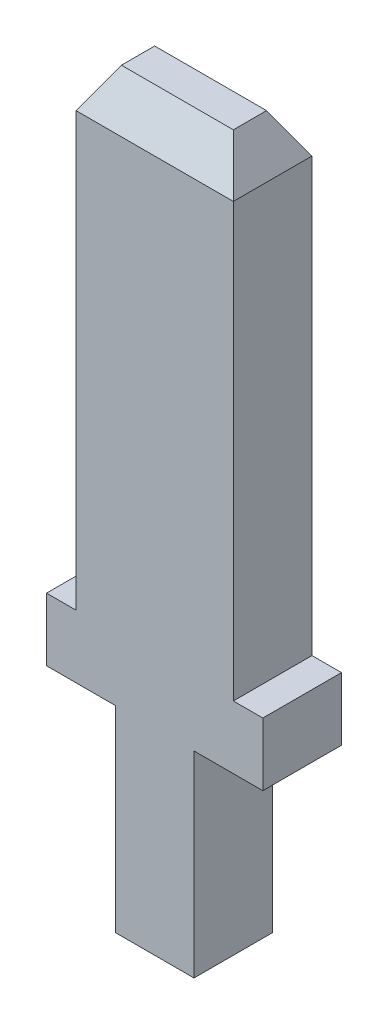
ISO-10303-21;
HEADER;
FILE_DESCRIPTION(('STEP AP214'),'2;1');
FILE_NAME('part.step','',(''),(''),'','','');
FILE_SCHEMA(('AUTOMOTIVE_DESIGN { 1 0 10303 214 1 1 1 1 }'));
ENDSEC;
DATA;
#1=APPLICATION_CONTEXT('core data for automotive mechanical design processes');
#2=APPLICATION_PROTOCOL_DEFINITION('international standard','automotive_design',2000,#1);
#3=PRODUCT_CONTEXT('',#1,'mechanical');
#4=PRODUCT('Part','Part','',(#3));
#5=PRODUCT_RELATED_PRODUCT_CATEGORY('part','',(#4));
#6=PRODUCT_DEFINITION_FORMATION('','',#4);
#7=PRODUCT_DEFINITION_CONTEXT('part definition',#1,'design');
#8=PRODUCT_DEFINITION('design','',#6,#7);
#9=PRODUCT_DEFINITION_SHAPE('','',#8);
#10=(LENGTH_UNIT() NAMED_UNIT(*) SI_UNIT(.MILLI.,.METRE.));
#11=(NAMED_UNIT(*) PLANE_ANGLE_UNIT() SI_UNIT($,.RADIAN.));
#12=(NAMED_UNIT(*) SI_UNIT($,.STERADIAN.) SOLID_ANGLE_UNIT());
#13=UNCERTAINTY_MEASURE_WITH_UNIT(LENGTH_MEASURE(1.E-05),#10,'distance_accuracy_value','');
#14=(GEOMETRIC_REPRESENTATION_CONTEXT(3) GLOBAL_UNCERTAINTY_ASSIGNED_CONTEXT((#13)) GLOBAL_UNIT_ASSIGNED_CONTEXT((#10,
#11,#12)) REPRESENTATION_CONTEXT('',''));
#15=CARTESIAN_POINT('',(0.,0.,0.));
#16=DIRECTION('',(0.,0.,1.));
#17=DIRECTION('',(1.,0.,0.));
#18=AXIS2_PLACEMENT_3D('',#15,#16,#17);
#19=CARTESIAN_POINT('',(-0.999999999999998,0.,1.));
#20=DIRECTION('',(1.,0.,0.));
#21=DIRECTION('',(0.,1.,0.));
#22=AXIS2_PLACEMENT_3D('',#19,#20,#21);
#23=PLANE('',#22);
#24=DIRECTION('',(0.,-1.,0.));
#25=VECTOR('',#24,1.);
#26=CARTESIAN_POINT('',(-0.999999999999998,0.,-1.));
#27=LINE('',#26,#25);
#28=CARTESIAN_POINT('',(-0.999999999999998,5.,-1.));
#29=VERTEX_POINT('',#28);
#30=CARTESIAN_POINT('',(-0.999999999999998,0.,-1.));
#31=VERTEX_POINT('',#30);
#32=EDGE_CURVE('E158',#29,#31,#27,.T.);
#33=ORIENTED_EDGE('',*,*,#32,.T.);
#34=DIRECTION('',(0.,0.,-1.));
#35=VECTOR('',#34,1.);
#36=CARTESIAN_POINT('',(-0.999999999999998,0.,1.));
#37=LINE('',#36,#35);
#38=CARTESIAN_POINT('',(-0.999999999999998,0.,1.));
#39=VERTEX_POINT('',#38);
#40=EDGE_CURVE('E140',#39,#31,#37,.T.);
#41=ORIENTED_EDGE('',*,*,#40,.F.);
#42=DIRECTION('',(0.,-1.,0.));
#43=VECTOR('',#42,1.);
#44=CARTESIAN_POINT('',(-0.999999999999998,0.,1.));
#45=LINE('',#44,#43);
#46=CARTESIAN_POINT('',(-0.999999999999998,5.,1.));
#47=VERTEX_POINT('',#46);
#48=EDGE_CURVE('E146',#47,#39,#45,.T.);
#49=ORIENTED_EDGE('',*,*,#48,.F.);
#50=DIRECTION('',(0.,0.,-1.));
#51=VECTOR('',#50,1.);
#52=CARTESIAN_POINT('',(-0.999999999999998,5.,1.));
#53=LINE('',#52,#51);
#54=EDGE_CURVE('E215',#47,#29,#53,.T.);
#55=ORIENTED_EDGE('',*,*,#54,.T.);
#56=EDGE_LOOP('',(#33,#41,#49,#55));
#57=FACE_BOUND('',#56,.T.);
#58=ADVANCED_FACE('F34',(#57),#23,.F.);
#59=CARTESIAN_POINT('',(0.999999999999998,0.,1.));
#60=DIRECTION('',(0.,1.,0.));
#61=DIRECTION('',(-1.,0.,0.));
#62=AXIS2_PLACEMENT_3D('',#59,#60,#61);
#63=PLANE('',#62);
#64=DIRECTION('',(1.,0.,0.));
#65=VECTOR('',#64,1.);
#66=CARTESIAN_POINT('',(0.999999999999998,0.,-1.));
#67=LINE('',#66,#65);
#68=CARTESIAN_POINT('',(0.999999999999998,0.,-1.));
#69=VERTEX_POINT('',#68);
#70=EDGE_CURVE('E191',#31,#69,#67,.T.);
#71=ORIENTED_EDGE('',*,*,#70,.T.);
#72=DIRECTION('',(0.,0.,-1.));
#73=VECTOR('',#72,1.);
#74=CARTESIAN_POINT('',(0.999999999999998,0.,1.));
#75=LINE('',#74,#73);
#76=CARTESIAN_POINT('',(0.999999999999998,0.,1.));
#77=VERTEX_POINT('',#76);
#78=EDGE_CURVE('E143',#77,#69,#75,.T.);
#79=ORIENTED_EDGE('',*,*,#78,.F.);
#80=DIRECTION('',(1.,0.,0.));
#81=VECTOR('',#80,1.);
#82=CARTESIAN_POINT('',(0.999999999999998,0.,1.));
#83=LINE('',#82,#81);
#84=EDGE_CURVE('E136',#39,#77,#83,.T.);
#85=ORIENTED_EDGE('',*,*,#84,.F.);
#86=ORIENTED_EDGE('',*,*,#40,.T.);
#87=EDGE_LOOP('',(#71,#79,#85,#86));
#88=FACE_BOUND('',#87,.T.);
#89=ADVANCED_FACE('F138',(#88),#63,.F.);
#90=CARTESIAN_POINT('',(0.999999999999998,0.,1.));
#91=DIRECTION('',(-1.,0.,0.));
#92=DIRECTION('',(0.,-1.,0.));
#93=AXIS2_PLACEMENT_3D('',#90,#91,#92);
#94=PLANE('',#93);
#95=DIRECTION('',(0.,1.,0.));
#96=VECTOR('',#95,1.);
#97=CARTESIAN_POINT('',(0.999999999999998,0.,-1.));
#98=LINE('',#97,#96);
#99=CARTESIAN_POINT('',(1.,5.,-1.));
#100=VERTEX_POINT('',#99);
#101=EDGE_CURVE('E193',#69,#100,#98,.T.);
#102=ORIENTED_EDGE('',*,*,#101,.T.);
#103=DIRECTION('',(0.,0.,-1.));
#104=VECTOR('',#103,1.);
#105=CARTESIAN_POINT('',(1.,5.,1.));
#106=LINE('',#105,#104);
#107=CARTESIAN_POINT('',(1.,5.,1.));
#108=VERTEX_POINT('',#107);
#109=EDGE_CURVE('E163',#108,#100,#106,.T.);
#110=ORIENTED_EDGE('',*,*,#109,.F.);
#111=DIRECTION('',(0.,1.,0.));
#112=VECTOR('',#111,1.);
#113=CARTESIAN_POINT('',(0.999999999999998,0.,1.));
#114=LINE('',#113,#112);
#115=EDGE_CURVE('E145',#77,#108,#114,.T.);
#116=ORIENTED_EDGE('',*,*,#115,.F.);
#117=ORIENTED_EDGE('',*,*,#78,.T.);
#118=EDGE_LOOP('',(#102,#110,#116,#117));
#119=FACE_BOUND('',#118,.T.);
#120=ADVANCED_FACE('F280',(#119),#94,.F.);
#121=CARTESIAN_POINT('',(1.,5.,1.));
#122=DIRECTION('',(0.,1.,0.));
#123=DIRECTION('',(-1.,0.,0.));
#124=AXIS2_PLACEMENT_3D('',#121,#122,#123);
#125=PLANE('',#124);
#126=DIRECTION('',(1.,0.,0.));
#127=VECTOR('',#126,1.);
#128=CARTESIAN_POINT('',(1.,5.,-1.));
#129=LINE('',#128,#127);
#130=CARTESIAN_POINT('',(2.75,5.,-1.));
#131=VERTEX_POINT('',#130);
#132=EDGE_CURVE('E199',#100,#131,#129,.T.);
#133=ORIENTED_EDGE('',*,*,#132,.T.);
#134=DIRECTION('',(0.,0.,-1.));
#135=VECTOR('',#134,1.);
#136=CARTESIAN_POINT('',(2.75,5.,1.));
#137=LINE('',#136,#135);
#138=CARTESIAN_POINT('',(2.75,5.,1.));
#139=VERTEX_POINT('',#138);
#140=EDGE_CURVE('E232',#139,#131,#137,.T.);
#141=ORIENTED_EDGE('',*,*,#140,.F.);
#142=DIRECTION('',(1.,0.,0.));
#143=VECTOR('',#142,1.);
#144=CARTESIAN_POINT('',(1.,5.,1.));
#145=LINE('',#144,#143);
#146=EDGE_CURVE('E241',#108,#139,#145,.T.);
#147=ORIENTED_EDGE('',*,*,#146,.F.);
#148=ORIENTED_EDGE('',*,*,#109,.T.);
#149=EDGE_LOOP('',(#133,#141,#147,#148));
#150=FACE_BOUND('',#149,.T.);
#151=ADVANCED_FACE('F239',(#150),#125,.F.);
#152=CARTESIAN_POINT('',(2.75,5.,1.));
#153=DIRECTION('',(-1.,0.,0.));
#154=DIRECTION('',(0.,-1.,0.));
#155=AXIS2_PLACEMENT_3D('',#152,#153,#154);
#156=PLANE('',#155);
#157=DIRECTION('',(0.,1.,0.));
#158=VECTOR('',#157,1.);
#159=CARTESIAN_POINT('',(2.75,5.,-1.));
#160=LINE('',#159,#158);
#161=CARTESIAN_POINT('',(2.75,6.6,-1.));
#162=VERTEX_POINT('',#161);
#163=EDGE_CURVE('E201',#131,#162,#160,.T.);
#164=ORIENTED_EDGE('',*,*,#163,.T.);
#165=DIRECTION('',(0.,0.,-1.));
#166=VECTOR('',#165,1.);
#167=CARTESIAN_POINT('',(2.75,6.6,1.));
#168=LINE('',#167,#166);
#169=CARTESIAN_POINT('',(2.75,6.6,1.));
#170=VERTEX_POINT('',#169);
#171=EDGE_CURVE('E229',#170,#162,#168,.T.);
#172=ORIENTED_EDGE('',*,*,#171,.F.);
#173=DIRECTION('',(0.,1.,0.));
#174=VECTOR('',#173,1.);
#175=CARTESIAN_POINT('',(2.75,5.,1.));
#176=LINE('',#175,#174);
#177=EDGE_CURVE('E260',#139,#170,#176,.T.);
#178=ORIENTED_EDGE('',*,*,#177,.F.);
#179=ORIENTED_EDGE('',*,*,#140,.T.);
#180=EDGE_LOOP('',(#164,#172,#178,#179));
#181=FACE_BOUND('',#180,.T.);
#182=ADVANCED_FACE('F251',(#181),#156,.F.);
#183=CARTESIAN_POINT('',(2.75,6.6,1.));
#184=DIRECTION('',(0.,-1.,0.));
#185=DIRECTION('',(0.,0.,-1.));
#186=AXIS2_PLACEMENT_3D('',#183,#184,#185);
#187=PLANE('',#186);
#188=DIRECTION('',(-1.,0.,0.));
#189=VECTOR('',#188,1.);
#190=CARTESIAN_POINT('',(2.75,6.6,-1.));
#191=LINE('',#190,#189);
#192=CARTESIAN_POINT('',(2.,6.6,-1.));
#193=VERTEX_POINT('',#192);
#194=EDGE_CURVE('E203',#162,#193,#191,.T.);
#195=ORIENTED_EDGE('',*,*,#194,.T.);
#196=DIRECTION('',(0.,0.,-1.));
#197=VECTOR('',#196,1.);
#198=CARTESIAN_POINT('',(2.,6.6,1.));
#199=LINE('',#198,#197);
#200=CARTESIAN_POINT('',(2.,6.6,1.));
#201=VERTEX_POINT('',#200);
#202=EDGE_CURVE('E226',#201,#193,#199,.T.);
#203=ORIENTED_EDGE('',*,*,#202,.F.);
#204=DIRECTION('',(-1.,0.,0.));
#205=VECTOR('',#204,1.);
#206=CARTESIAN_POINT('',(2.75,6.6,1.));
#207=LINE('',#206,#205);
#208=EDGE_CURVE('E257',#170,#201,#207,.T.);
#209=ORIENTED_EDGE('',*,*,#208,.F.);
#210=ORIENTED_EDGE('',*,*,#171,.T.);
#211=EDGE_LOOP('',(#195,#203,#209,#210));
#212=FACE_BOUND('',#211,.T.);
#213=ADVANCED_FACE('F255',(#212),#187,.F.);
#214=CARTESIAN_POINT('',(2.,6.6,1.));
#215=DIRECTION('',(-1.,0.,0.));
#216=DIRECTION('',(0.,-1.,0.));
#217=AXIS2_PLACEMENT_3D('',#214,#215,#216);
#218=PLANE('',#217);
#219=DIRECTION('',(0.,1.,0.));
#220=VECTOR('',#219,1.);
#221=CARTESIAN_POINT('',(2.,6.6,-1.));
#222=LINE('',#221,#220);
#223=CARTESIAN_POINT('',(2.,17.6,-1.));
#224=VERTEX_POINT('',#223);
#225=EDGE_CURVE('E205',#193,#224,#222,.T.);
#226=ORIENTED_EDGE('',*,*,#225,.T.);
#227=DIRECTION('',(0.,0.,1.));
#228=VECTOR('',#227,1.);
#229=CARTESIAN_POINT('',(2.,17.6,1.));
#230=LINE('',#229,#228);
#231=CARTESIAN_POINT('',(2.,17.6,1.));
#232=VERTEX_POINT('',#231);
#233=EDGE_CURVE('E173',#224,#232,#230,.T.);
#234=ORIENTED_EDGE('',*,*,#233,.T.);
#235=DIRECTION('',(0.,1.,0.));
#236=VECTOR('',#235,1.);
#237=CARTESIAN_POINT('',(2.,6.6,1.));
#238=LINE('',#237,#236);
#239=EDGE_CURVE('E259',#201,#232,#238,.T.);
#240=ORIENTED_EDGE('',*,*,#239,.F.);
#241=ORIENTED_EDGE('',*,*,#202,.T.);
#242=EDGE_LOOP('',(#226,#234,#240,#241));
#243=FACE_BOUND('',#242,.T.);
#244=ADVANCED_FACE('F316',(#243),#218,.F.);
#245=CARTESIAN_POINT('',(-2.,18.6,1.));
#246=DIRECTION('',(0.,-1.,0.));
#247=DIRECTION('',(0.,0.,-1.));
#248=AXIS2_PLACEMENT_3D('',#245,#246,#247);
#249=PLANE('',#248);
#250=DIRECTION('',(1.,0.,0.));
#251=VECTOR('',#250,1.);
#252=CARTESIAN_POINT('',(2.,18.6,0.422649730810374));
#253=LINE('',#252,#251);
#254=CARTESIAN_POINT('',(-1.42264973081037,18.6,0.422649730810374));
#255=VERTEX_POINT('',#254);
#256=CARTESIAN_POINT('',(1.42264973081037,18.6,0.422649730810374));
#257=VERTEX_POINT('',#256);
#258=EDGE_CURVE('E168',#255,#257,#253,.T.);
#259=ORIENTED_EDGE('',*,*,#258,.T.);
#260=DIRECTION('',(0.,0.,-1.));
#261=VECTOR('',#260,1.);
#262=CARTESIAN_POINT('',(1.42264973081037,18.6,1.));
#263=LINE('',#262,#261);
#264=CARTESIAN_POINT('',(1.42264973081037,18.6,-0.422649730810374));
#265=VERTEX_POINT('',#264);
#266=EDGE_CURVE('E170',#257,#265,#263,.T.);
#267=ORIENTED_EDGE('',*,*,#266,.T.);
#268=DIRECTION('',(-1.,0.,0.));
#269=VECTOR('',#268,1.);
#270=CARTESIAN_POINT('',(-2.,18.6,-0.422649730810374));
#271=LINE('',#270,#269);
#272=CARTESIAN_POINT('',(-1.42264973081037,18.6,-0.422649730810374));
#273=VERTEX_POINT('',#272);
#274=EDGE_CURVE('E159',#265,#273,#271,.T.);
#275=ORIENTED_EDGE('',*,*,#274,.T.);
#276=DIRECTION('',(0.,0.,1.));
#277=VECTOR('',#276,1.);
#278=CARTESIAN_POINT('',(-1.42264973081037,18.6,1.));
#279=LINE('',#278,#277);
#280=EDGE_CURVE('E161',#273,#255,#279,.T.);
#281=ORIENTED_EDGE('',*,*,#280,.T.);
#282=EDGE_LOOP('',(#259,#267,#275,#281));
#283=FACE_BOUND('',#282,.T.);
#284=ADVANCED_FACE('F320',(#283),#249,.F.);
#285=CARTESIAN_POINT('',(-2.,6.6,1.));
#286=DIRECTION('',(1.,0.,0.));
#287=DIRECTION('',(0.,0.,-1.));
#288=AXIS2_PLACEMENT_3D('',#285,#286,#287);
#289=PLANE('',#288);
#290=DIRECTION('',(0.,-1.,0.));
#291=VECTOR('',#290,1.);
#292=CARTESIAN_POINT('',(-2.,6.6,1.));
#293=LINE('',#292,#291);
#294=CARTESIAN_POINT('',(-2.,17.6,1.));
#295=VERTEX_POINT('',#294);
#296=CARTESIAN_POINT('',(-2.,6.6,1.));
#297=VERTEX_POINT('',#296);
#298=EDGE_CURVE('E262',#295,#297,#293,.T.);
#299=ORIENTED_EDGE('',*,*,#298,.F.);
#300=DIRECTION('',(0.,0.,-1.));
#301=VECTOR('',#300,1.);
#302=CARTESIAN_POINT('',(-2.,17.6,1.));
#303=LINE('',#302,#301);
#304=CARTESIAN_POINT('',(-2.,17.6,-1.));
#305=VERTEX_POINT('',#304);
#306=EDGE_CURVE('E43',#295,#305,#303,.T.);
#307=ORIENTED_EDGE('',*,*,#306,.T.);
#308=DIRECTION('',(0.,-1.,0.));
#309=VECTOR('',#308,1.);
#310=CARTESIAN_POINT('',(-2.,6.6,-1.));
#311=LINE('',#310,#309);
#312=CARTESIAN_POINT('',(-2.,6.6,-1.));
#313=VERTEX_POINT('',#312);
#314=EDGE_CURVE('E208',#305,#313,#311,.T.);
#315=ORIENTED_EDGE('',*,*,#314,.T.);
#316=DIRECTION('',(0.,0.,-1.));
#317=VECTOR('',#316,1.);
#318=CARTESIAN_POINT('',(-2.,6.6,1.));
#319=LINE('',#318,#317);
#320=EDGE_CURVE('E223',#297,#313,#319,.T.);
#321=ORIENTED_EDGE('',*,*,#320,.F.);
#322=EDGE_LOOP('',(#299,#307,#315,#321));
#323=FACE_BOUND('',#322,.T.);
#324=ADVANCED_FACE('F322',(#323),#289,.F.);
#325=CARTESIAN_POINT('',(-2.75,6.6,1.));
#326=DIRECTION('',(0.,-1.,0.));
#327=DIRECTION('',(0.,0.,-1.));
#328=AXIS2_PLACEMENT_3D('',#325,#326,#327);
#329=PLANE('',#328);
#330=DIRECTION('',(-1.,0.,0.));
#331=VECTOR('',#330,1.);
#332=CARTESIAN_POINT('',(-2.75,6.6,-1.));
#333=LINE('',#332,#331);
#334=CARTESIAN_POINT('',(-2.75,6.6,-1.));
#335=VERTEX_POINT('',#334);
#336=EDGE_CURVE('E210',#313,#335,#333,.T.);
#337=ORIENTED_EDGE('',*,*,#336,.T.);
#338=DIRECTION('',(0.,0.,-1.));
#339=VECTOR('',#338,1.);
#340=CARTESIAN_POINT('',(-2.75,6.6,1.));
#341=LINE('',#340,#339);
#342=CARTESIAN_POINT('',(-2.75,6.6,1.));
#343=VERTEX_POINT('',#342);
#344=EDGE_CURVE('E220',#343,#335,#341,.T.);
#345=ORIENTED_EDGE('',*,*,#344,.F.);
#346=DIRECTION('',(-1.,0.,0.));
#347=VECTOR('',#346,1.);
#348=CARTESIAN_POINT('',(-2.75,6.6,1.));
#349=LINE('',#348,#347);
#350=EDGE_CURVE('E268',#297,#343,#349,.T.);
#351=ORIENTED_EDGE('',*,*,#350,.F.);
#352=ORIENTED_EDGE('',*,*,#320,.T.);
#353=EDGE_LOOP('',(#337,#345,#351,#352));
#354=FACE_BOUND('',#353,.T.);
#355=ADVANCED_FACE('F328',(#354),#329,.F.);
#356=CARTESIAN_POINT('',(-2.75,5.,1.));
#357=DIRECTION('',(1.,0.,0.));
#358=DIRECTION('',(0.,0.,-1.));
#359=AXIS2_PLACEMENT_3D('',#356,#357,#358);
#360=PLANE('',#359);
#361=DIRECTION('',(0.,-1.,0.));
#362=VECTOR('',#361,1.);
#363=CARTESIAN_POINT('',(-2.75,5.,-1.));
#364=LINE('',#363,#362);
#365=CARTESIAN_POINT('',(-2.75,5.,-1.));
#366=VERTEX_POINT('',#365);
#367=EDGE_CURVE('E212',#335,#366,#364,.T.);
#368=ORIENTED_EDGE('',*,*,#367,.T.);
#369=DIRECTION('',(0.,0.,-1.));
#370=VECTOR('',#369,1.);
#371=CARTESIAN_POINT('',(-2.75,5.,1.));
#372=LINE('',#371,#370);
#373=CARTESIAN_POINT('',(-2.75,5.,1.));
#374=VERTEX_POINT('',#373);
#375=EDGE_CURVE('E217',#374,#366,#372,.T.);
#376=ORIENTED_EDGE('',*,*,#375,.F.);
#377=DIRECTION('',(0.,-1.,0.));
#378=VECTOR('',#377,1.);
#379=CARTESIAN_POINT('',(-2.75,5.,1.));
#380=LINE('',#379,#378);
#381=EDGE_CURVE('E269',#343,#374,#380,.T.);
#382=ORIENTED_EDGE('',*,*,#381,.F.);
#383=ORIENTED_EDGE('',*,*,#344,.T.);
#384=EDGE_LOOP('',(#368,#376,#382,#383));
#385=FACE_BOUND('',#384,.T.);
#386=ADVANCED_FACE('F275',(#385),#360,.F.);
#387=CARTESIAN_POINT('',(-0.999999999999998,5.,1.));
#388=DIRECTION('',(0.,1.,0.));
#389=DIRECTION('',(0.,0.,1.));
#390=AXIS2_PLACEMENT_3D('',#387,#388,#389);
#391=PLANE('',#390);
#392=DIRECTION('',(1.,0.,0.));
#393=VECTOR('',#392,1.);
#394=CARTESIAN_POINT('',(-0.999999999999998,5.,-1.));
#395=LINE('',#394,#393);
#396=EDGE_CURVE('E155',#366,#29,#395,.T.);
#397=ORIENTED_EDGE('',*,*,#396,.T.);
#398=ORIENTED_EDGE('',*,*,#54,.F.);
#399=DIRECTION('',(1.,0.,0.));
#400=VECTOR('',#399,1.);
#401=CARTESIAN_POINT('',(-0.999999999999998,5.,1.));
#402=LINE('',#401,#400);
#403=EDGE_CURVE('E151',#374,#47,#402,.T.);
#404=ORIENTED_EDGE('',*,*,#403,.F.);
#405=ORIENTED_EDGE('',*,*,#375,.T.);
#406=EDGE_LOOP('',(#397,#398,#404,#405));
#407=FACE_BOUND('',#406,.T.);
#408=ADVANCED_FACE('F279',(#407),#391,.F.);
#409=CARTESIAN_POINT('',(0.,0.,1.));
#410=DIRECTION('',(0.,0.,1.));
#411=DIRECTION('',(1.,0.,0.));
#412=AXIS2_PLACEMENT_3D('',#409,#410,#411);
#413=PLANE('',#412);
#414=ORIENTED_EDGE('',*,*,#239,.T.);
#415=DIRECTION('',(-1.,0.,0.));
#416=VECTOR('',#415,1.);
#417=CARTESIAN_POINT('',(-2.,17.6,1.));
#418=LINE('',#417,#416);
#419=EDGE_CURVE('E58',#232,#295,#418,.T.);
#420=ORIENTED_EDGE('',*,*,#419,.T.);
#421=ORIENTED_EDGE('',*,*,#298,.T.);
#422=ORIENTED_EDGE('',*,*,#350,.T.);
#423=ORIENTED_EDGE('',*,*,#381,.T.);
#424=ORIENTED_EDGE('',*,*,#403,.T.);
#425=ORIENTED_EDGE('',*,*,#48,.T.);
#426=ORIENTED_EDGE('',*,*,#84,.T.);
#427=ORIENTED_EDGE('',*,*,#115,.T.);
#428=ORIENTED_EDGE('',*,*,#146,.T.);
#429=ORIENTED_EDGE('',*,*,#177,.T.);
#430=ORIENTED_EDGE('',*,*,#208,.T.);
#431=EDGE_LOOP('',(#414,#420,#421,#422,#423,#424,#425,#426,#427,#428,#429,#430));
#432=FACE_BOUND('',#431,.T.);
#433=ADVANCED_FACE('F149',(#432),#413,.T.);
#434=CARTESIAN_POINT('',(0.,0.,-1.));
#435=DIRECTION('',(0.,0.,1.));
#436=DIRECTION('',(1.,0.,0.));
#437=AXIS2_PLACEMENT_3D('',#434,#435,#436);
#438=PLANE('',#437);
#439=ORIENTED_EDGE('',*,*,#314,.F.);
#440=DIRECTION('',(1.,0.,0.));
#441=VECTOR('',#440,1.);
#442=CARTESIAN_POINT('',(0.,17.6,-1.));
#443=LINE('',#442,#441);
#444=EDGE_CURVE('E11',#305,#224,#443,.T.);
#445=ORIENTED_EDGE('',*,*,#444,.T.);
#446=ORIENTED_EDGE('',*,*,#225,.F.);
#447=ORIENTED_EDGE('',*,*,#194,.F.);
#448=ORIENTED_EDGE('',*,*,#163,.F.);
#449=ORIENTED_EDGE('',*,*,#132,.F.);
#450=ORIENTED_EDGE('',*,*,#101,.F.);
#451=ORIENTED_EDGE('',*,*,#70,.F.);
#452=ORIENTED_EDGE('',*,*,#32,.F.);
#453=ORIENTED_EDGE('',*,*,#396,.F.);
#454=ORIENTED_EDGE('',*,*,#367,.F.);
#455=ORIENTED_EDGE('',*,*,#336,.F.);
#456=EDGE_LOOP('',(#439,#445,#446,#447,#448,#449,#450,#451,#452,#453,#454,#455));
#457=FACE_BOUND('',#456,.T.);
#458=ADVANCED_FACE('F246',(#457),#438,.F.);
#459=CARTESIAN_POINT('',(-2.,17.6,1.));
#460=DIRECTION('',(0.86602540378444,-0.499999999999997,0.));
#461=DIRECTION('',(0.,0.,-1.));
#462=AXIS2_PLACEMENT_3D('',#459,#460,#461);
#463=PLANE('',#462);
#464=DIRECTION('',(0.447213595499956,0.774596669241486,0.447213595499956));
#465=VECTOR('',#464,1.);
#466=CARTESIAN_POINT('',(-1.5381197846483,18.4,-0.538119784648298));
#467=LINE('',#466,#465);
#468=EDGE_CURVE('E181',#305,#273,#467,.T.);
#469=ORIENTED_EDGE('',*,*,#468,.F.);
#470=ORIENTED_EDGE('',*,*,#306,.F.);
#471=DIRECTION('',(-0.447213595499956,-0.774596669241486,0.447213595499956));
#472=VECTOR('',#471,1.);
#473=CARTESIAN_POINT('',(-2.,17.6,1.));
#474=LINE('',#473,#472);
#475=EDGE_CURVE('E38',#255,#295,#474,.T.);
#476=ORIENTED_EDGE('',*,*,#475,.F.);
#477=ORIENTED_EDGE('',*,*,#280,.F.);
#478=EDGE_LOOP('',(#469,#470,#476,#477));
#479=FACE_BOUND('',#478,.T.);
#480=ADVANCED_FACE('F36',(#479),#463,.F.);
#481=CARTESIAN_POINT('',(0.,17.6,1.));
#482=DIRECTION('',(0.,0.499999999999997,0.86602540378444));
#483=DIRECTION('',(1.,0.,0.));
#484=AXIS2_PLACEMENT_3D('',#481,#482,#483);
#485=PLANE('',#484);
#486=ORIENTED_EDGE('',*,*,#475,.T.);
#487=ORIENTED_EDGE('',*,*,#419,.F.);
#488=DIRECTION('',(0.447213595499956,-0.774596669241485,0.447213595499956));
#489=VECTOR('',#488,1.);
#490=CARTESIAN_POINT('',(1.6,18.2928203230275,0.600000000000004));
#491=LINE('',#490,#489);
#492=EDGE_CURVE('E180',#257,#232,#491,.T.);
#493=ORIENTED_EDGE('',*,*,#492,.F.);
#494=ORIENTED_EDGE('',*,*,#258,.F.);
#495=EDGE_LOOP('',(#486,#487,#493,#494));
#496=FACE_BOUND('',#495,.T.);
#497=ADVANCED_FACE('F301',(#496),#485,.T.);
#498=CARTESIAN_POINT('',(-2.,18.6,-0.422649730810374));
#499=DIRECTION('',(0.,-0.499999999999997,0.86602540378444));
#500=DIRECTION('',(-1.,0.,0.));
#501=AXIS2_PLACEMENT_3D('',#498,#499,#500);
#502=PLANE('',#501);
#503=ORIENTED_EDGE('',*,*,#468,.T.);
#504=ORIENTED_EDGE('',*,*,#274,.F.);
#505=DIRECTION('',(0.447213595499956,-0.774596669241485,-0.447213595499956));
#506=VECTOR('',#505,1.);
#507=CARTESIAN_POINT('',(0.738119784648303,19.7856406460551,0.261880215351695));
#508=LINE('',#507,#506);
#509=EDGE_CURVE('E178',#224,#265,#508,.F.);
#510=ORIENTED_EDGE('',*,*,#509,.F.);
#511=ORIENTED_EDGE('',*,*,#444,.F.);
#512=EDGE_LOOP('',(#503,#504,#510,#511));
#513=FACE_BOUND('',#512,.T.);
#514=ADVANCED_FACE('F298',(#513),#502,.F.);
#515=CARTESIAN_POINT('',(1.42264973081037,18.6,1.));
#516=DIRECTION('',(-0.86602540378444,-0.499999999999998,0.));
#517=DIRECTION('',(0.,0.,-1.));
#518=AXIS2_PLACEMENT_3D('',#515,#516,#517);
#519=PLANE('',#518);
#520=ORIENTED_EDGE('',*,*,#492,.T.);
#521=ORIENTED_EDGE('',*,*,#233,.F.);
#522=ORIENTED_EDGE('',*,*,#509,.T.);
#523=ORIENTED_EDGE('',*,*,#266,.F.);
#524=EDGE_LOOP('',(#520,#521,#522,#523));
#525=FACE_BOUND('',#524,.T.);
#526=ADVANCED_FACE('F295',(#525),#519,.F.);
#527=CLOSED_SHELL('',(#58,#89,#120,#151,#182,#213,#244,#284,#324,#355,#386,#408,#433,#458,#480,
#497,#514,#526));
#528=MANIFOLD_SOLID_BREP('B2',#527);
#529=ADVANCED_BREP_SHAPE_REPRESENTATION('',(#18,#528),#14);
#530=SHAPE_DEFINITION_REPRESENTATION(#9,#529);
ENDSEC;
END-ISO-10303-21;
